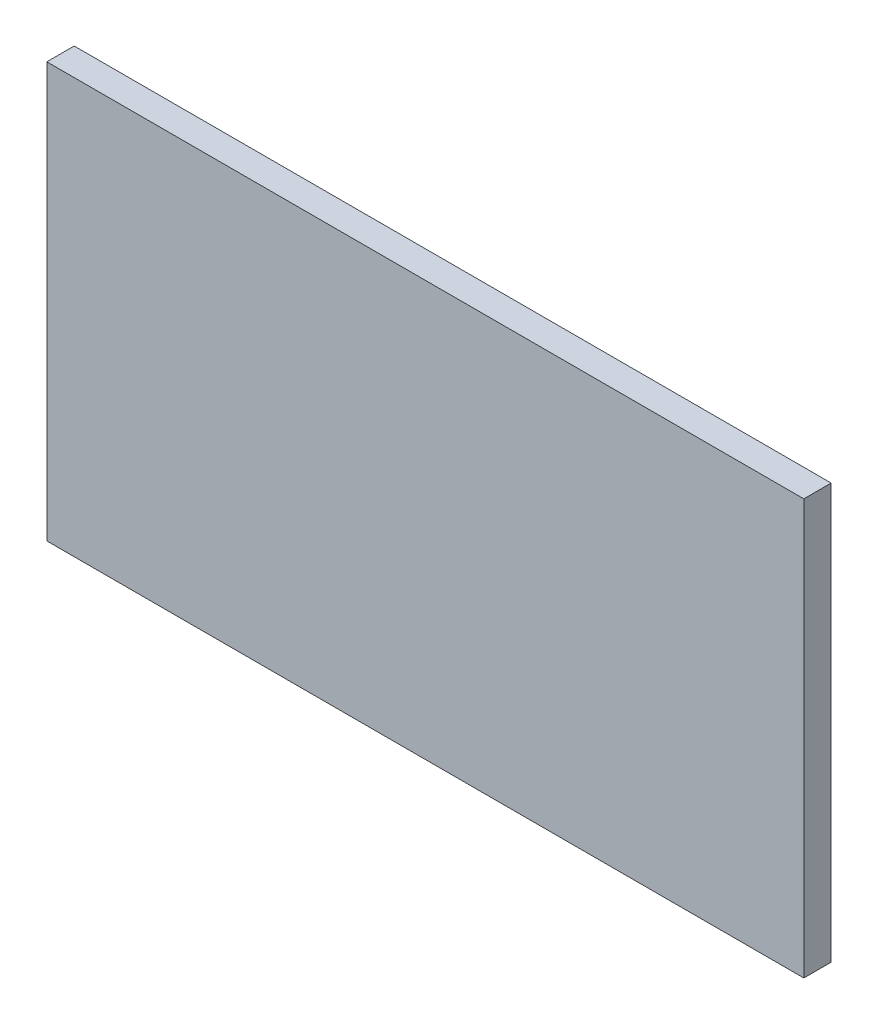
ISO-10303-21;
HEADER;
FILE_DESCRIPTION(('STEP AP214'),'2;1');
FILE_NAME('part.step','',(''),(''),'','','');
FILE_SCHEMA(('AUTOMOTIVE_DESIGN { 1 0 10303 214 1 1 1 1 }'));
ENDSEC;
DATA;
#1=APPLICATION_CONTEXT('core data for automotive mechanical design processes');
#2=APPLICATION_PROTOCOL_DEFINITION('international standard','automotive_design',2000,#1);
#3=PRODUCT_CONTEXT('',#1,'mechanical');
#4=PRODUCT('Part','Part','',(#3));
#5=PRODUCT_RELATED_PRODUCT_CATEGORY('part','',(#4));
#6=PRODUCT_DEFINITION_FORMATION('','',#4);
#7=PRODUCT_DEFINITION_CONTEXT('part definition',#1,'design');
#8=PRODUCT_DEFINITION('design','',#6,#7);
#9=PRODUCT_DEFINITION_SHAPE('','',#8);
#10=(LENGTH_UNIT() NAMED_UNIT(*) SI_UNIT(.MILLI.,.METRE.));
#11=(NAMED_UNIT(*) PLANE_ANGLE_UNIT() SI_UNIT($,.RADIAN.));
#12=(NAMED_UNIT(*) SI_UNIT($,.STERADIAN.) SOLID_ANGLE_UNIT());
#13=UNCERTAINTY_MEASURE_WITH_UNIT(LENGTH_MEASURE(1.E-05),#10,'distance_accuracy_value','');
#14=(GEOMETRIC_REPRESENTATION_CONTEXT(3) GLOBAL_UNCERTAINTY_ASSIGNED_CONTEXT((#13)) GLOBAL_UNIT_ASSIGNED_CONTEXT((#10,
#11,#12)) REPRESENTATION_CONTEXT('',''));
#15=CARTESIAN_POINT('',(0.,0.,0.));
#16=DIRECTION('',(0.,0.,1.));
#17=DIRECTION('',(1.,0.,0.));
#18=AXIS2_PLACEMENT_3D('',#15,#16,#17);
#19=CARTESIAN_POINT('',(0.,0.,0.));
#20=DIRECTION('',(0.,0.,-1.));
#21=DIRECTION('',(-1.,0.,0.));
#22=AXIS2_PLACEMENT_3D('',#19,#20,#21);
#23=PLANE('',#22);
#24=DIRECTION('',(1.,0.,0.));
#25=VECTOR('',#24,1.);
#26=CARTESIAN_POINT('',(0.,3.,0.));
#27=LINE('',#26,#25);
#28=CARTESIAN_POINT('',(19.75,3.,0.));
#29=VERTEX_POINT('',#28);
#30=CARTESIAN_POINT('',(24.5,3.,0.));
#31=VERTEX_POINT('',#30);
#32=EDGE_CURVE('E169',#29,#31,#27,.T.);
#33=ORIENTED_EDGE('',*,*,#32,.T.);
#34=DIRECTION('',(0.,-1.,0.));
#35=VECTOR('',#34,1.);
#36=CARTESIAN_POINT('',(24.5,0.,0.));
#37=LINE('',#36,#35);
#38=CARTESIAN_POINT('',(24.5,15.,0.));
#39=VERTEX_POINT('',#38);
#40=EDGE_CURVE('E162',#39,#31,#37,.T.);
#41=ORIENTED_EDGE('',*,*,#40,.F.);
#42=DIRECTION('',(1.,0.,0.));
#43=VECTOR('',#42,1.);
#44=CARTESIAN_POINT('',(0.,15.,0.));
#45=LINE('',#44,#43);
#46=CARTESIAN_POINT('',(19.75,15.,0.));
#47=VERTEX_POINT('',#46);
#48=EDGE_CURVE('E180',#47,#39,#45,.T.);
#49=ORIENTED_EDGE('',*,*,#48,.F.);
#50=DIRECTION('',(0.,-1.,0.));
#51=VECTOR('',#50,1.);
#52=CARTESIAN_POINT('',(19.75,0.,0.));
#53=LINE('',#52,#51);
#54=EDGE_CURVE('E60',#47,#29,#53,.T.);
#55=ORIENTED_EDGE('',*,*,#54,.T.);
#56=EDGE_LOOP('',(#33,#41,#49,#55));
#57=FACE_BOUND('',#56,.T.);
#58=DIRECTION('',(0.,1.,0.));
#59=VECTOR('',#58,1.);
#60=CARTESIAN_POINT('',(0.,0.,0.));
#61=LINE('',#60,#59);
#62=CARTESIAN_POINT('',(0.,0.,0.));
#63=VERTEX_POINT('',#62);
#64=CARTESIAN_POINT('',(0.,22.75,0.));
#65=VERTEX_POINT('',#64);
#66=EDGE_CURVE('E187',#63,#65,#61,.T.);
#67=ORIENTED_EDGE('',*,*,#66,.T.);
#68=DIRECTION('',(1.,0.,0.));
#69=VECTOR('',#68,1.);
#70=CARTESIAN_POINT('',(0.,22.75,0.));
#71=LINE('',#70,#69);
#72=CARTESIAN_POINT('',(41.5,22.75,0.));
#73=VERTEX_POINT('',#72);
#74=EDGE_CURVE('E207',#65,#73,#71,.T.);
#75=ORIENTED_EDGE('',*,*,#74,.T.);
#76=DIRECTION('',(0.,1.,0.));
#77=VECTOR('',#76,1.);
#78=CARTESIAN_POINT('',(41.5,0.,0.));
#79=LINE('',#78,#77);
#80=CARTESIAN_POINT('',(41.5,0.,0.));
#81=VERTEX_POINT('',#80);
#82=EDGE_CURVE('E210',#81,#73,#79,.T.);
#83=ORIENTED_EDGE('',*,*,#82,.F.);
#84=DIRECTION('',(1.,0.,0.));
#85=VECTOR('',#84,1.);
#86=CARTESIAN_POINT('',(0.,0.,0.));
#87=LINE('',#86,#85);
#88=EDGE_CURVE('E198',#63,#81,#87,.T.);
#89=ORIENTED_EDGE('',*,*,#88,.F.);
#90=EDGE_LOOP('',(#67,#75,#83,#89));
#91=FACE_BOUND('',#90,.T.);
#92=DIRECTION('',(1.,0.,0.));
#93=VECTOR('',#92,1.);
#94=CARTESIAN_POINT('',(0.,12.25,0.));
#95=LINE('',#94,#93);
#96=CARTESIAN_POINT('',(5.5,12.25,0.));
#97=VERTEX_POINT('',#96);
#98=CARTESIAN_POINT('',(9.5,12.25,0.));
#99=VERTEX_POINT('',#98);
#100=EDGE_CURVE('E150',#97,#99,#95,.T.);
#101=ORIENTED_EDGE('',*,*,#100,.T.);
#102=DIRECTION('',(0.,-1.,0.));
#103=VECTOR('',#102,1.);
#104=CARTESIAN_POINT('',(9.50000000000001,0.,0.));
#105=LINE('',#104,#103);
#106=CARTESIAN_POINT('',(9.5,15.25,0.));
#107=VERTEX_POINT('',#106);
#108=EDGE_CURVE('E157',#107,#99,#105,.T.);
#109=ORIENTED_EDGE('',*,*,#108,.F.);
#110=DIRECTION('',(1.,0.,0.));
#111=VECTOR('',#110,1.);
#112=CARTESIAN_POINT('',(0.,15.25,0.));
#113=LINE('',#112,#111);
#114=CARTESIAN_POINT('',(5.5,15.25,0.));
#115=VERTEX_POINT('',#114);
#116=EDGE_CURVE('E140',#115,#107,#113,.T.);
#117=ORIENTED_EDGE('',*,*,#116,.F.);
#118=DIRECTION('',(0.,-1.,0.));
#119=VECTOR('',#118,1.);
#120=CARTESIAN_POINT('',(5.5,0.,0.));
#121=LINE('',#120,#119);
#122=EDGE_CURVE('E52',#115,#97,#121,.T.);
#123=ORIENTED_EDGE('',*,*,#122,.T.);
#124=EDGE_LOOP('',(#101,#109,#117,#123));
#125=FACE_BOUND('',#124,.T.);
#126=ADVANCED_FACE('F35',(#57,#91,#125),#23,.T.);
#127=CARTESIAN_POINT('',(0.,0.,1.5));
#128=DIRECTION('',(-1.,0.,0.));
#129=DIRECTION('',(0.,0.,1.));
#130=AXIS2_PLACEMENT_3D('',#127,#128,#129);
#131=PLANE('',#130);
#132=ORIENTED_EDGE('',*,*,#66,.F.);
#133=DIRECTION('',(0.,0.,-1.));
#134=VECTOR('',#133,1.);
#135=CARTESIAN_POINT('',(0.,0.,1.5));
#136=LINE('',#135,#134);
#137=CARTESIAN_POINT('',(0.,0.,1.5));
#138=VERTEX_POINT('',#137);
#139=EDGE_CURVE('E11',#138,#63,#136,.T.);
#140=ORIENTED_EDGE('',*,*,#139,.F.);
#141=DIRECTION('',(0.,1.,0.));
#142=VECTOR('',#141,1.);
#143=CARTESIAN_POINT('',(0.,0.,1.5));
#144=LINE('',#143,#142);
#145=CARTESIAN_POINT('',(0.,22.75,1.5));
#146=VERTEX_POINT('',#145);
#147=EDGE_CURVE('E194',#138,#146,#144,.T.);
#148=ORIENTED_EDGE('',*,*,#147,.T.);
#149=DIRECTION('',(0.,0.,-1.));
#150=VECTOR('',#149,1.);
#151=CARTESIAN_POINT('',(0.,22.75,1.5));
#152=LINE('',#151,#150);
#153=EDGE_CURVE('E39',#146,#65,#152,.T.);
#154=ORIENTED_EDGE('',*,*,#153,.T.);
#155=EDGE_LOOP('',(#132,#140,#148,#154));
#156=FACE_BOUND('',#155,.T.);
#157=ADVANCED_FACE('F37',(#156),#131,.T.);
#158=CARTESIAN_POINT('',(0.,0.,1.5));
#159=DIRECTION('',(0.,1.,0.));
#160=DIRECTION('',(0.,0.,1.));
#161=AXIS2_PLACEMENT_3D('',#158,#159,#160);
#162=PLANE('',#161);
#163=ORIENTED_EDGE('',*,*,#88,.T.);
#164=DIRECTION('',(0.,0.,-1.));
#165=VECTOR('',#164,1.);
#166=CARTESIAN_POINT('',(41.5,0.,1.5));
#167=LINE('',#166,#165);
#168=CARTESIAN_POINT('',(41.5,0.,1.5));
#169=VERTEX_POINT('',#168);
#170=EDGE_CURVE('E44',#169,#81,#167,.T.);
#171=ORIENTED_EDGE('',*,*,#170,.F.);
#172=DIRECTION('',(1.,0.,0.));
#173=VECTOR('',#172,1.);
#174=CARTESIAN_POINT('',(0.,0.,1.5));
#175=LINE('',#174,#173);
#176=EDGE_CURVE('E203',#138,#169,#175,.T.);
#177=ORIENTED_EDGE('',*,*,#176,.F.);
#178=ORIENTED_EDGE('',*,*,#139,.T.);
#179=EDGE_LOOP('',(#163,#171,#177,#178));
#180=FACE_BOUND('',#179,.T.);
#181=ADVANCED_FACE('F230',(#180),#162,.F.);
#182=CARTESIAN_POINT('',(41.5,0.,1.5));
#183=DIRECTION('',(-1.,0.,0.));
#184=DIRECTION('',(0.,0.,1.));
#185=AXIS2_PLACEMENT_3D('',#182,#183,#184);
#186=PLANE('',#185);
#187=ORIENTED_EDGE('',*,*,#82,.T.);
#188=DIRECTION('',(0.,0.,-1.));
#189=VECTOR('',#188,1.);
#190=CARTESIAN_POINT('',(41.5,22.75,1.5));
#191=LINE('',#190,#189);
#192=CARTESIAN_POINT('',(41.5,22.75,1.5));
#193=VERTEX_POINT('',#192);
#194=EDGE_CURVE('E215',#193,#73,#191,.T.);
#195=ORIENTED_EDGE('',*,*,#194,.F.);
#196=DIRECTION('',(0.,1.,0.));
#197=VECTOR('',#196,1.);
#198=CARTESIAN_POINT('',(41.5,0.,1.5));
#199=LINE('',#198,#197);
#200=EDGE_CURVE('E201',#169,#193,#199,.T.);
#201=ORIENTED_EDGE('',*,*,#200,.F.);
#202=ORIENTED_EDGE('',*,*,#170,.T.);
#203=EDGE_LOOP('',(#187,#195,#201,#202));
#204=FACE_BOUND('',#203,.T.);
#205=ADVANCED_FACE('F234',(#204),#186,.F.);
#206=CARTESIAN_POINT('',(0.,22.75,1.5));
#207=DIRECTION('',(0.,1.,0.));
#208=DIRECTION('',(0.,0.,1.));
#209=AXIS2_PLACEMENT_3D('',#206,#207,#208);
#210=PLANE('',#209);
#211=ORIENTED_EDGE('',*,*,#74,.F.);
#212=ORIENTED_EDGE('',*,*,#153,.F.);
#213=DIRECTION('',(1.,0.,0.));
#214=VECTOR('',#213,1.);
#215=CARTESIAN_POINT('',(0.,22.75,1.5));
#216=LINE('',#215,#214);
#217=EDGE_CURVE('E197',#146,#193,#216,.T.);
#218=ORIENTED_EDGE('',*,*,#217,.T.);
#219=ORIENTED_EDGE('',*,*,#194,.T.);
#220=EDGE_LOOP('',(#211,#212,#218,#219));
#221=FACE_BOUND('',#220,.T.);
#222=ADVANCED_FACE('F223',(#221),#210,.T.);
#223=CARTESIAN_POINT('',(0.,0.,1.5));
#224=DIRECTION('',(0.,0.,-1.));
#225=DIRECTION('',(-1.,0.,0.));
#226=AXIS2_PLACEMENT_3D('',#223,#224,#225);
#227=PLANE('',#226);
#228=ORIENTED_EDGE('',*,*,#147,.F.);
#229=ORIENTED_EDGE('',*,*,#176,.T.);
#230=ORIENTED_EDGE('',*,*,#200,.T.);
#231=ORIENTED_EDGE('',*,*,#217,.F.);
#232=EDGE_LOOP('',(#228,#229,#230,#231));
#233=FACE_BOUND('',#232,.T.);
#234=ADVANCED_FACE('F236',(#233),#227,.F.);
#235=CARTESIAN_POINT('',(24.5,0.,-2.));
#236=DIRECTION('',(-1.,0.,0.));
#237=DIRECTION('',(0.,0.,1.));
#238=AXIS2_PLACEMENT_3D('',#235,#236,#237);
#239=PLANE('',#238);
#240=ORIENTED_EDGE('',*,*,#40,.T.);
#241=DIRECTION('',(0.,0.,1.));
#242=VECTOR('',#241,1.);
#243=CARTESIAN_POINT('',(24.5,3.,-2.));
#244=LINE('',#243,#242);
#245=CARTESIAN_POINT('',(24.5,3.,-2.));
#246=VERTEX_POINT('',#245);
#247=EDGE_CURVE('E185',#246,#31,#244,.T.);
#248=ORIENTED_EDGE('',*,*,#247,.F.);
#249=DIRECTION('',(0.,-1.,0.));
#250=VECTOR('',#249,1.);
#251=CARTESIAN_POINT('',(24.5,0.,-2.));
#252=LINE('',#251,#250);
#253=CARTESIAN_POINT('',(24.5,15.,-2.));
#254=VERTEX_POINT('',#253);
#255=EDGE_CURVE('E166',#254,#246,#252,.T.);
#256=ORIENTED_EDGE('',*,*,#255,.F.);
#257=DIRECTION('',(0.,0.,1.));
#258=VECTOR('',#257,1.);
#259=CARTESIAN_POINT('',(24.5,15.,-2.));
#260=LINE('',#259,#258);
#261=EDGE_CURVE('E177',#254,#39,#260,.T.);
#262=ORIENTED_EDGE('',*,*,#261,.T.);
#263=EDGE_LOOP('',(#240,#248,#256,#262));
#264=FACE_BOUND('',#263,.T.);
#265=ADVANCED_FACE('F238',(#264),#239,.F.);
#266=CARTESIAN_POINT('',(0.,3.,-2.));
#267=DIRECTION('',(0.,-1.,0.));
#268=DIRECTION('',(1.,0.,0.));
#269=AXIS2_PLACEMENT_3D('',#266,#267,#268);
#270=PLANE('',#269);
#271=ORIENTED_EDGE('',*,*,#32,.F.);
#272=DIRECTION('',(0.,0.,1.));
#273=VECTOR('',#272,1.);
#274=CARTESIAN_POINT('',(19.75,3.,-2.));
#275=LINE('',#274,#273);
#276=CARTESIAN_POINT('',(19.75,3.,-2.));
#277=VERTEX_POINT('',#276);
#278=EDGE_CURVE('E188',#277,#29,#275,.T.);
#279=ORIENTED_EDGE('',*,*,#278,.F.);
#280=DIRECTION('',(1.,0.,0.));
#281=VECTOR('',#280,1.);
#282=CARTESIAN_POINT('',(0.,3.,-2.));
#283=LINE('',#282,#281);
#284=EDGE_CURVE('E174',#277,#246,#283,.T.);
#285=ORIENTED_EDGE('',*,*,#284,.T.);
#286=ORIENTED_EDGE('',*,*,#247,.T.);
#287=EDGE_LOOP('',(#271,#279,#285,#286));
#288=FACE_BOUND('',#287,.T.);
#289=ADVANCED_FACE('F244',(#288),#270,.T.);
#290=CARTESIAN_POINT('',(19.75,0.,-2.));
#291=DIRECTION('',(-1.,0.,0.));
#292=DIRECTION('',(0.,0.,1.));
#293=AXIS2_PLACEMENT_3D('',#290,#291,#292);
#294=PLANE('',#293);
#295=ORIENTED_EDGE('',*,*,#54,.F.);
#296=DIRECTION('',(0.,0.,1.));
#297=VECTOR('',#296,1.);
#298=CARTESIAN_POINT('',(19.75,15.,-2.));
#299=LINE('',#298,#297);
#300=CARTESIAN_POINT('',(19.75,15.,-2.));
#301=VERTEX_POINT('',#300);
#302=EDGE_CURVE('E190',#301,#47,#299,.T.);
#303=ORIENTED_EDGE('',*,*,#302,.F.);
#304=DIRECTION('',(0.,-1.,0.));
#305=VECTOR('',#304,1.);
#306=CARTESIAN_POINT('',(19.75,0.,-2.));
#307=LINE('',#306,#305);
#308=EDGE_CURVE('E171',#301,#277,#307,.T.);
#309=ORIENTED_EDGE('',*,*,#308,.T.);
#310=ORIENTED_EDGE('',*,*,#278,.T.);
#311=EDGE_LOOP('',(#295,#303,#309,#310));
#312=FACE_BOUND('',#311,.T.);
#313=ADVANCED_FACE('F288',(#312),#294,.T.);
#314=CARTESIAN_POINT('',(0.,15.,-2.));
#315=DIRECTION('',(0.,-1.,0.));
#316=DIRECTION('',(0.,0.,-1.));
#317=AXIS2_PLACEMENT_3D('',#314,#315,#316);
#318=PLANE('',#317);
#319=ORIENTED_EDGE('',*,*,#48,.T.);
#320=ORIENTED_EDGE('',*,*,#261,.F.);
#321=DIRECTION('',(1.,0.,0.));
#322=VECTOR('',#321,1.);
#323=CARTESIAN_POINT('',(0.,15.,-2.));
#324=LINE('',#323,#322);
#325=EDGE_CURVE('E168',#301,#254,#324,.T.);
#326=ORIENTED_EDGE('',*,*,#325,.F.);
#327=ORIENTED_EDGE('',*,*,#302,.T.);
#328=EDGE_LOOP('',(#319,#320,#326,#327));
#329=FACE_BOUND('',#328,.T.);
#330=ADVANCED_FACE('F298',(#329),#318,.F.);
#331=CARTESIAN_POINT('',(0.,0.,-2.));
#332=DIRECTION('',(0.,0.,1.));
#333=DIRECTION('',(1.,0.,0.));
#334=AXIS2_PLACEMENT_3D('',#331,#332,#333);
#335=PLANE('',#334);
#336=ORIENTED_EDGE('',*,*,#255,.T.);
#337=ORIENTED_EDGE('',*,*,#284,.F.);
#338=ORIENTED_EDGE('',*,*,#308,.F.);
#339=ORIENTED_EDGE('',*,*,#325,.T.);
#340=EDGE_LOOP('',(#336,#337,#338,#339));
#341=FACE_BOUND('',#340,.T.);
#342=ADVANCED_FACE('F307',(#341),#335,.F.);
#343=CARTESIAN_POINT('',(9.50000000000001,0.,-2.));
#344=DIRECTION('',(-1.,0.,0.));
#345=DIRECTION('',(0.,-1.,0.));
#346=AXIS2_PLACEMENT_3D('',#343,#344,#345);
#347=PLANE('',#346);
#348=ORIENTED_EDGE('',*,*,#108,.T.);
#349=DIRECTION('',(0.,0.,1.));
#350=VECTOR('',#349,1.);
#351=CARTESIAN_POINT('',(9.5,12.25,-2.));
#352=LINE('',#351,#350);
#353=CARTESIAN_POINT('',(9.5,12.25,-2.));
#354=VERTEX_POINT('',#353);
#355=EDGE_CURVE('E148',#354,#99,#352,.T.);
#356=ORIENTED_EDGE('',*,*,#355,.F.);
#357=DIRECTION('',(0.,-1.,0.));
#358=VECTOR('',#357,1.);
#359=CARTESIAN_POINT('',(9.50000000000001,0.,-2.));
#360=LINE('',#359,#358);
#361=CARTESIAN_POINT('',(9.5,15.25,-2.));
#362=VERTEX_POINT('',#361);
#363=EDGE_CURVE('E130',#362,#354,#360,.T.);
#364=ORIENTED_EDGE('',*,*,#363,.F.);
#365=DIRECTION('',(0.,0.,1.));
#366=VECTOR('',#365,1.);
#367=CARTESIAN_POINT('',(9.5,15.25,-2.));
#368=LINE('',#367,#366);
#369=EDGE_CURVE('E137',#362,#107,#368,.T.);
#370=ORIENTED_EDGE('',*,*,#369,.T.);
#371=EDGE_LOOP('',(#348,#356,#364,#370));
#372=FACE_BOUND('',#371,.T.);
#373=ADVANCED_FACE('F147',(#372),#347,.F.);
#374=CARTESIAN_POINT('',(0.,12.25,-2.));
#375=DIRECTION('',(0.,-1.,0.));
#376=DIRECTION('',(0.,0.,-1.));
#377=AXIS2_PLACEMENT_3D('',#374,#375,#376);
#378=PLANE('',#377);
#379=ORIENTED_EDGE('',*,*,#100,.F.);
#380=DIRECTION('',(0.,0.,1.));
#381=VECTOR('',#380,1.);
#382=CARTESIAN_POINT('',(5.5,12.25,-2.));
#383=LINE('',#382,#381);
#384=CARTESIAN_POINT('',(5.5,12.25,-2.));
#385=VERTEX_POINT('',#384);
#386=EDGE_CURVE('E163',#385,#97,#383,.T.);
#387=ORIENTED_EDGE('',*,*,#386,.F.);
#388=DIRECTION('',(1.,0.,0.));
#389=VECTOR('',#388,1.);
#390=CARTESIAN_POINT('',(0.,12.25,-2.));
#391=LINE('',#390,#389);
#392=EDGE_CURVE('E145',#385,#354,#391,.T.);
#393=ORIENTED_EDGE('',*,*,#392,.T.);
#394=ORIENTED_EDGE('',*,*,#355,.T.);
#395=EDGE_LOOP('',(#379,#387,#393,#394));
#396=FACE_BOUND('',#395,.T.);
#397=ADVANCED_FACE('F326',(#396),#378,.T.);
#398=CARTESIAN_POINT('',(5.5,0.,-2.));
#399=DIRECTION('',(-1.,0.,0.));
#400=DIRECTION('',(0.,0.,1.));
#401=AXIS2_PLACEMENT_3D('',#398,#399,#400);
#402=PLANE('',#401);
#403=ORIENTED_EDGE('',*,*,#122,.F.);
#404=DIRECTION('',(0.,0.,1.));
#405=VECTOR('',#404,1.);
#406=CARTESIAN_POINT('',(5.5,15.25,-2.));
#407=LINE('',#406,#405);
#408=CARTESIAN_POINT('',(5.5,15.25,-2.));
#409=VERTEX_POINT('',#408);
#410=EDGE_CURVE('E144',#409,#115,#407,.T.);
#411=ORIENTED_EDGE('',*,*,#410,.F.);
#412=DIRECTION('',(0.,-1.,0.));
#413=VECTOR('',#412,1.);
#414=CARTESIAN_POINT('',(5.5,0.,-2.));
#415=LINE('',#414,#413);
#416=EDGE_CURVE('E133',#409,#385,#415,.T.);
#417=ORIENTED_EDGE('',*,*,#416,.T.);
#418=ORIENTED_EDGE('',*,*,#386,.T.);
#419=EDGE_LOOP('',(#403,#411,#417,#418));
#420=FACE_BOUND('',#419,.T.);
#421=ADVANCED_FACE('F335',(#420),#402,.T.);
#422=CARTESIAN_POINT('',(0.,15.25,-2.));
#423=DIRECTION('',(0.,-1.,0.));
#424=DIRECTION('',(1.,0.,0.));
#425=AXIS2_PLACEMENT_3D('',#422,#423,#424);
#426=PLANE('',#425);
#427=ORIENTED_EDGE('',*,*,#116,.T.);
#428=ORIENTED_EDGE('',*,*,#369,.F.);
#429=DIRECTION('',(1.,0.,0.));
#430=VECTOR('',#429,1.);
#431=CARTESIAN_POINT('',(0.,15.25,-2.));
#432=LINE('',#431,#430);
#433=EDGE_CURVE('E125',#409,#362,#432,.T.);
#434=ORIENTED_EDGE('',*,*,#433,.F.);
#435=ORIENTED_EDGE('',*,*,#410,.T.);
#436=EDGE_LOOP('',(#427,#428,#434,#435));
#437=FACE_BOUND('',#436,.T.);
#438=ADVANCED_FACE('F138',(#437),#426,.F.);
#439=CARTESIAN_POINT('',(0.,0.,-2.));
#440=DIRECTION('',(0.,0.,1.));
#441=DIRECTION('',(1.,0.,0.));
#442=AXIS2_PLACEMENT_3D('',#439,#440,#441);
#443=PLANE('',#442);
#444=ORIENTED_EDGE('',*,*,#363,.T.);
#445=ORIENTED_EDGE('',*,*,#392,.F.);
#446=ORIENTED_EDGE('',*,*,#416,.F.);
#447=ORIENTED_EDGE('',*,*,#433,.T.);
#448=EDGE_LOOP('',(#444,#445,#446,#447));
#449=FACE_BOUND('',#448,.T.);
#450=ADVANCED_FACE('F127',(#449),#443,.F.);
#451=CLOSED_SHELL('',(#126,#157,#181,#205,#222,#234,#265,#289,#313,#330,#342,#373,#397,#421,
#438,#450));
#452=MANIFOLD_SOLID_BREP('B2',#451);
#453=ADVANCED_BREP_SHAPE_REPRESENTATION('',(#18,#452),#14);
#454=SHAPE_DEFINITION_REPRESENTATION(#9,#453);
ENDSEC;
END-ISO-10303-21;
